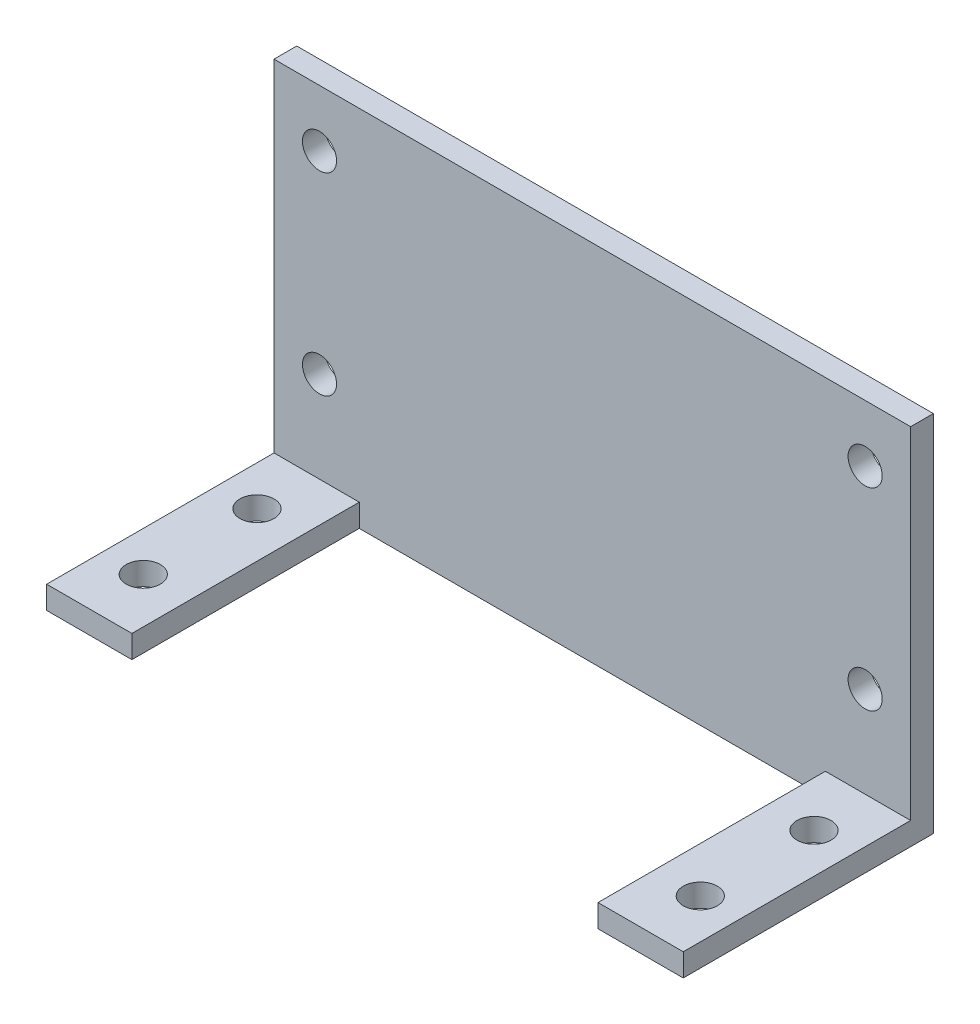
ISO-10303-21;
HEADER;
FILE_DESCRIPTION(('STEP AP214'),'2;1');
FILE_NAME('part.step','',(''),(''),'','','');
FILE_SCHEMA(('AUTOMOTIVE_DESIGN { 1 0 10303 214 1 1 1 1 }'));
ENDSEC;
DATA;
#1=APPLICATION_CONTEXT('core data for automotive mechanical design processes');
#2=APPLICATION_PROTOCOL_DEFINITION('international standard','automotive_design',2000,#1);
#3=PRODUCT_CONTEXT('',#1,'mechanical');
#4=PRODUCT('Part','Part','',(#3));
#5=PRODUCT_RELATED_PRODUCT_CATEGORY('part','',(#4));
#6=PRODUCT_DEFINITION_FORMATION('','',#4);
#7=PRODUCT_DEFINITION_CONTEXT('part definition',#1,'design');
#8=PRODUCT_DEFINITION('design','',#6,#7);
#9=PRODUCT_DEFINITION_SHAPE('','',#8);
#10=(LENGTH_UNIT() NAMED_UNIT(*) SI_UNIT(.MILLI.,.METRE.));
#11=(NAMED_UNIT(*) PLANE_ANGLE_UNIT() SI_UNIT($,.RADIAN.));
#12=(NAMED_UNIT(*) SI_UNIT($,.STERADIAN.) SOLID_ANGLE_UNIT());
#13=UNCERTAINTY_MEASURE_WITH_UNIT(LENGTH_MEASURE(1.E-05),#10,'distance_accuracy_value','');
#14=(GEOMETRIC_REPRESENTATION_CONTEXT(3) GLOBAL_UNCERTAINTY_ASSIGNED_CONTEXT((#13)) GLOBAL_UNIT_ASSIGNED_CONTEXT((#10,
#11,#12)) REPRESENTATION_CONTEXT('',''));
#15=CARTESIAN_POINT('',(0.,0.,0.));
#16=DIRECTION('',(0.,0.,1.));
#17=DIRECTION('',(1.,0.,0.));
#18=AXIS2_PLACEMENT_3D('',#15,#16,#17);
#19=CARTESIAN_POINT('',(-28.,2.,11.));
#20=DIRECTION('',(0.,0.,-1.));
#21=DIRECTION('',(-1.,0.,0.));
#22=AXIS2_PLACEMENT_3D('',#19,#20,#21);
#23=PLANE('',#22);
#24=DIRECTION('',(1.,0.,0.));
#25=VECTOR('',#24,1.);
#26=CARTESIAN_POINT('',(-28.,0.,11.));
#27=LINE('',#26,#25);
#28=CARTESIAN_POINT('',(-28.,0.,11.));
#29=VERTEX_POINT('',#28);
#30=CARTESIAN_POINT('',(-20.5,0.,11.));
#31=VERTEX_POINT('',#30);
#32=EDGE_CURVE('E128',#29,#31,#27,.T.);
#33=ORIENTED_EDGE('',*,*,#32,.T.);
#34=DIRECTION('',(0.,1.,0.));
#35=VECTOR('',#34,1.);
#36=CARTESIAN_POINT('',(-20.5,-18.,11.));
#37=LINE('',#36,#35);
#38=CARTESIAN_POINT('',(-20.5,2.,11.));
#39=VERTEX_POINT('',#38);
#40=EDGE_CURVE('E115',#31,#39,#37,.T.);
#41=ORIENTED_EDGE('',*,*,#40,.T.);
#42=DIRECTION('',(1.,0.,0.));
#43=VECTOR('',#42,1.);
#44=CARTESIAN_POINT('',(-28.,2.,11.));
#45=LINE('',#44,#43);
#46=CARTESIAN_POINT('',(-28.,2.,11.));
#47=VERTEX_POINT('',#46);
#48=EDGE_CURVE('E126',#47,#39,#45,.T.);
#49=ORIENTED_EDGE('',*,*,#48,.F.);
#50=DIRECTION('',(0.,-1.,0.));
#51=VECTOR('',#50,1.);
#52=CARTESIAN_POINT('',(-28.,2.,11.));
#53=LINE('',#52,#51);
#54=EDGE_CURVE('E42',#47,#29,#53,.T.);
#55=ORIENTED_EDGE('',*,*,#54,.T.);
#56=EDGE_LOOP('',(#33,#41,#49,#55));
#57=FACE_BOUND('',#56,.T.);
#58=ADVANCED_FACE('F33',(#57),#23,.F.);
#59=CARTESIAN_POINT('',(0.,2.,0.));
#60=DIRECTION('',(0.,1.,0.));
#61=DIRECTION('',(0.,0.,1.));
#62=AXIS2_PLACEMENT_3D('',#59,#60,#61);
#63=PLANE('',#62);
#64=CARTESIAN_POINT('',(-24.5,2.,6.));
#65=DIRECTION('',(0.,1.,0.));
#66=DIRECTION('',(0.,0.,1.));
#67=AXIS2_PLACEMENT_3D('',#64,#65,#66);
#68=CIRCLE('',#67,1.5);
#69=CARTESIAN_POINT('',(-24.5,2.,7.5));
#70=VERTEX_POINT('',#69);
#71=EDGE_CURVE('E172',#70,#70,#68,.T.);
#72=ORIENTED_EDGE('',*,*,#71,.F.);
#73=EDGE_LOOP('',(#72));
#74=FACE_BOUND('',#73,.T.);
#75=CARTESIAN_POINT('',(-24.5,2.,-4.));
#76=DIRECTION('',(0.,1.,0.));
#77=DIRECTION('',(0.,0.,1.));
#78=AXIS2_PLACEMENT_3D('',#75,#76,#77);
#79=CIRCLE('',#78,1.5);
#80=CARTESIAN_POINT('',(-24.5,2.,-2.49999999999999));
#81=VERTEX_POINT('',#80);
#82=EDGE_CURVE('E168',#81,#81,#79,.T.);
#83=ORIENTED_EDGE('',*,*,#82,.F.);
#84=EDGE_LOOP('',(#83));
#85=FACE_BOUND('',#84,.T.);
#86=DIRECTION('',(0.,0.,1.));
#87=VECTOR('',#86,1.);
#88=CARTESIAN_POINT('',(-20.5,2.,-9.));
#89=LINE('',#88,#87);
#90=CARTESIAN_POINT('',(-20.5,2.,-9.));
#91=VERTEX_POINT('',#90);
#92=EDGE_CURVE('E112',#91,#39,#89,.T.);
#93=ORIENTED_EDGE('',*,*,#92,.F.);
#94=DIRECTION('',(1.,0.,0.));
#95=VECTOR('',#94,1.);
#96=CARTESIAN_POINT('',(-28.,2.,-9.));
#97=LINE('',#96,#95);
#98=CARTESIAN_POINT('',(-28.,2.,-9.));
#99=VERTEX_POINT('',#98);
#100=EDGE_CURVE('E58',#99,#91,#97,.T.);
#101=ORIENTED_EDGE('',*,*,#100,.F.);
#102=DIRECTION('',(0.,0.,1.));
#103=VECTOR('',#102,1.);
#104=CARTESIAN_POINT('',(-28.,2.,-11.));
#105=LINE('',#104,#103);
#106=EDGE_CURVE('E132',#99,#47,#105,.T.);
#107=ORIENTED_EDGE('',*,*,#106,.T.);
#108=ORIENTED_EDGE('',*,*,#48,.T.);
#109=EDGE_LOOP('',(#93,#101,#107,#108));
#110=FACE_BOUND('',#109,.T.);
#111=ADVANCED_FACE('F131',(#74,#85,#110),#63,.T.);
#112=CARTESIAN_POINT('',(-28.,2.,-11.));
#113=DIRECTION('',(1.,0.,0.));
#114=DIRECTION('',(0.,0.,-1.));
#115=AXIS2_PLACEMENT_3D('',#112,#113,#114);
#116=PLANE('',#115);
#117=DIRECTION('',(0.,0.,1.));
#118=VECTOR('',#117,1.);
#119=CARTESIAN_POINT('',(-28.,0.,-11.));
#120=LINE('',#119,#118);
#121=CARTESIAN_POINT('',(-28.,0.,-11.));
#122=VERTEX_POINT('',#121);
#123=EDGE_CURVE('E145',#122,#29,#120,.T.);
#124=ORIENTED_EDGE('',*,*,#123,.T.);
#125=ORIENTED_EDGE('',*,*,#54,.F.);
#126=ORIENTED_EDGE('',*,*,#106,.F.);
#127=DIRECTION('',(0.,-1.,0.));
#128=VECTOR('',#127,1.);
#129=CARTESIAN_POINT('',(-28.,32.,-9.));
#130=LINE('',#129,#128);
#131=CARTESIAN_POINT('',(-28.,32.,-9.));
#132=VERTEX_POINT('',#131);
#133=EDGE_CURVE('E233',#132,#99,#130,.T.);
#134=ORIENTED_EDGE('',*,*,#133,.F.);
#135=DIRECTION('',(0.,0.,1.));
#136=VECTOR('',#135,1.);
#137=CARTESIAN_POINT('',(-28.,32.,-11.));
#138=LINE('',#137,#136);
#139=CARTESIAN_POINT('',(-28.,32.,-11.));
#140=VERTEX_POINT('',#139);
#141=EDGE_CURVE('E151',#140,#132,#138,.T.);
#142=ORIENTED_EDGE('',*,*,#141,.F.);
#143=DIRECTION('',(0.,-1.,0.));
#144=VECTOR('',#143,1.);
#145=CARTESIAN_POINT('',(-28.,2.,-11.));
#146=LINE('',#145,#144);
#147=EDGE_CURVE('E137',#140,#122,#146,.T.);
#148=ORIENTED_EDGE('',*,*,#147,.T.);
#149=EDGE_LOOP('',(#124,#125,#126,#134,#142,#148));
#150=FACE_BOUND('',#149,.T.);
#151=ADVANCED_FACE('F35',(#150),#116,.F.);
#152=CARTESIAN_POINT('',(20.5,2.,11.));
#153=VERTEX_POINT('',#152);
#154=CARTESIAN_POINT('',(28.,2.,11.));
#155=VERTEX_POINT('',#154);
#156=EDGE_CURVE('E134',#153,#155,#45,.T.);
#157=ORIENTED_EDGE('',*,*,#156,.F.);
#158=DIRECTION('',(0.,1.,0.));
#159=VECTOR('',#158,1.);
#160=CARTESIAN_POINT('',(20.5,-18.,11.));
#161=LINE('',#160,#159);
#162=CARTESIAN_POINT('',(20.5,0.,11.));
#163=VERTEX_POINT('',#162);
#164=EDGE_CURVE('E129',#163,#153,#161,.T.);
#165=ORIENTED_EDGE('',*,*,#164,.F.);
#166=CARTESIAN_POINT('',(28.,0.,11.));
#167=VERTEX_POINT('',#166);
#168=EDGE_CURVE('E241',#163,#167,#27,.T.);
#169=ORIENTED_EDGE('',*,*,#168,.T.);
#170=DIRECTION('',(0.,-1.,0.));
#171=VECTOR('',#170,1.);
#172=CARTESIAN_POINT('',(28.,2.,11.));
#173=LINE('',#172,#171);
#174=EDGE_CURVE('E260',#155,#167,#173,.T.);
#175=ORIENTED_EDGE('',*,*,#174,.F.);
#176=EDGE_LOOP('',(#157,#165,#169,#175));
#177=FACE_BOUND('',#176,.T.);
#178=ADVANCED_FACE('F273',(#177),#23,.F.);
#179=CARTESIAN_POINT('',(28.,2.,-11.));
#180=DIRECTION('',(-1.,0.,0.));
#181=DIRECTION('',(0.,0.,1.));
#182=AXIS2_PLACEMENT_3D('',#179,#180,#181);
#183=PLANE('',#182);
#184=DIRECTION('',(0.,0.,-1.));
#185=VECTOR('',#184,1.);
#186=CARTESIAN_POINT('',(28.,0.,-11.));
#187=LINE('',#186,#185);
#188=CARTESIAN_POINT('',(28.,0.,-11.));
#189=VERTEX_POINT('',#188);
#190=EDGE_CURVE('E251',#167,#189,#187,.T.);
#191=ORIENTED_EDGE('',*,*,#190,.T.);
#192=DIRECTION('',(0.,-1.,0.));
#193=VECTOR('',#192,1.);
#194=CARTESIAN_POINT('',(28.,2.,-11.));
#195=LINE('',#194,#193);
#196=CARTESIAN_POINT('',(28.,32.,-11.));
#197=VERTEX_POINT('',#196);
#198=EDGE_CURVE('E257',#197,#189,#195,.T.);
#199=ORIENTED_EDGE('',*,*,#198,.F.);
#200=DIRECTION('',(0.,0.,-1.));
#201=VECTOR('',#200,1.);
#202=CARTESIAN_POINT('',(28.,32.,-11.));
#203=LINE('',#202,#201);
#204=CARTESIAN_POINT('',(28.,32.,-9.));
#205=VERTEX_POINT('',#204);
#206=EDGE_CURVE('E225',#205,#197,#203,.T.);
#207=ORIENTED_EDGE('',*,*,#206,.F.);
#208=DIRECTION('',(0.,-1.,0.));
#209=VECTOR('',#208,1.);
#210=CARTESIAN_POINT('',(28.,32.,-9.));
#211=LINE('',#210,#209);
#212=CARTESIAN_POINT('',(28.,2.,-9.));
#213=VERTEX_POINT('',#212);
#214=EDGE_CURVE('E153',#205,#213,#211,.T.);
#215=ORIENTED_EDGE('',*,*,#214,.T.);
#216=DIRECTION('',(0.,0.,-1.));
#217=VECTOR('',#216,1.);
#218=CARTESIAN_POINT('',(28.,2.,-11.));
#219=LINE('',#218,#217);
#220=EDGE_CURVE('E133',#155,#213,#219,.T.);
#221=ORIENTED_EDGE('',*,*,#220,.F.);
#222=ORIENTED_EDGE('',*,*,#174,.T.);
#223=EDGE_LOOP('',(#191,#199,#207,#215,#221,#222));
#224=FACE_BOUND('',#223,.T.);
#225=ADVANCED_FACE('F264',(#224),#183,.F.);
#226=CARTESIAN_POINT('',(-28.,2.,-11.));
#227=DIRECTION('',(0.,0.,1.));
#228=DIRECTION('',(1.,0.,0.));
#229=AXIS2_PLACEMENT_3D('',#226,#227,#228);
#230=PLANE('',#229);
#231=CARTESIAN_POINT('',(-24.,27.,-11.));
#232=DIRECTION('',(0.,0.,-1.));
#233=DIRECTION('',(-1.,0.,0.));
#234=AXIS2_PLACEMENT_3D('',#231,#232,#233);
#235=CIRCLE('',#234,1.5);
#236=CARTESIAN_POINT('',(-25.5,27.,-11.));
#237=VERTEX_POINT('',#236);
#238=EDGE_CURVE('E200',#237,#237,#235,.T.);
#239=ORIENTED_EDGE('',*,*,#238,.F.);
#240=EDGE_LOOP('',(#239));
#241=FACE_BOUND('',#240,.T.);
#242=CARTESIAN_POINT('',(-24.,10.,-11.));
#243=DIRECTION('',(0.,0.,-1.));
#244=DIRECTION('',(-1.,0.,0.));
#245=AXIS2_PLACEMENT_3D('',#242,#243,#244);
#246=CIRCLE('',#245,1.5);
#247=CARTESIAN_POINT('',(-25.5,10.,-11.));
#248=VERTEX_POINT('',#247);
#249=EDGE_CURVE('E190',#248,#248,#246,.T.);
#250=ORIENTED_EDGE('',*,*,#249,.F.);
#251=EDGE_LOOP('',(#250));
#252=FACE_BOUND('',#251,.T.);
#253=CARTESIAN_POINT('',(24.,10.,-11.));
#254=DIRECTION('',(0.,0.,-1.));
#255=DIRECTION('',(-1.,0.,0.));
#256=AXIS2_PLACEMENT_3D('',#253,#254,#255);
#257=CIRCLE('',#256,1.5);
#258=CARTESIAN_POINT('',(22.5,10.,-11.));
#259=VERTEX_POINT('',#258);
#260=EDGE_CURVE('E187',#259,#259,#257,.T.);
#261=ORIENTED_EDGE('',*,*,#260,.F.);
#262=EDGE_LOOP('',(#261));
#263=FACE_BOUND('',#262,.T.);
#264=CARTESIAN_POINT('',(24.,27.,-11.));
#265=DIRECTION('',(0.,0.,-1.));
#266=DIRECTION('',(-1.,0.,0.));
#267=AXIS2_PLACEMENT_3D('',#264,#265,#266);
#268=CIRCLE('',#267,1.5);
#269=CARTESIAN_POINT('',(22.5,27.,-11.));
#270=VERTEX_POINT('',#269);
#271=EDGE_CURVE('E184',#270,#270,#268,.T.);
#272=ORIENTED_EDGE('',*,*,#271,.F.);
#273=EDGE_LOOP('',(#272));
#274=FACE_BOUND('',#273,.T.);
#275=DIRECTION('',(-1.,0.,0.));
#276=VECTOR('',#275,1.);
#277=CARTESIAN_POINT('',(-28.,0.,-11.));
#278=LINE('',#277,#276);
#279=EDGE_CURVE('E254',#189,#122,#278,.T.);
#280=ORIENTED_EDGE('',*,*,#279,.T.);
#281=ORIENTED_EDGE('',*,*,#147,.F.);
#282=DIRECTION('',(-1.,0.,0.));
#283=VECTOR('',#282,1.);
#284=CARTESIAN_POINT('',(-28.,32.,-11.));
#285=LINE('',#284,#283);
#286=EDGE_CURVE('E157',#197,#140,#285,.T.);
#287=ORIENTED_EDGE('',*,*,#286,.F.);
#288=ORIENTED_EDGE('',*,*,#198,.T.);
#289=EDGE_LOOP('',(#280,#281,#287,#288));
#290=FACE_BOUND('',#289,.T.);
#291=ADVANCED_FACE('F268',(#241,#252,#263,#274,#290),#230,.F.);
#292=CARTESIAN_POINT('',(24.5,2.,6.));
#293=DIRECTION('',(0.,1.,0.));
#294=DIRECTION('',(0.,0.,1.));
#295=AXIS2_PLACEMENT_3D('',#292,#293,#294);
#296=CIRCLE('',#295,1.5);
#297=CARTESIAN_POINT('',(24.5,2.,7.5));
#298=VERTEX_POINT('',#297);
#299=EDGE_CURVE('E180',#298,#298,#296,.T.);
#300=ORIENTED_EDGE('',*,*,#299,.F.);
#301=EDGE_LOOP('',(#300));
#302=FACE_BOUND('',#301,.T.);
#303=CARTESIAN_POINT('',(24.5,2.,-4.));
#304=DIRECTION('',(0.,1.,0.));
#305=DIRECTION('',(0.,0.,1.));
#306=AXIS2_PLACEMENT_3D('',#303,#304,#305);
#307=CIRCLE('',#306,1.5);
#308=CARTESIAN_POINT('',(24.5,2.,-2.5));
#309=VERTEX_POINT('',#308);
#310=EDGE_CURVE('E176',#309,#309,#307,.T.);
#311=ORIENTED_EDGE('',*,*,#310,.F.);
#312=EDGE_LOOP('',(#311));
#313=FACE_BOUND('',#312,.T.);
#314=DIRECTION('',(0.,0.,-1.));
#315=VECTOR('',#314,1.);
#316=CARTESIAN_POINT('',(20.5,2.,-9.));
#317=LINE('',#316,#315);
#318=CARTESIAN_POINT('',(20.5,2.,-9.));
#319=VERTEX_POINT('',#318);
#320=EDGE_CURVE('E50',#153,#319,#317,.T.);
#321=ORIENTED_EDGE('',*,*,#320,.F.);
#322=ORIENTED_EDGE('',*,*,#156,.T.);
#323=ORIENTED_EDGE('',*,*,#220,.T.);
#324=EDGE_CURVE('E152',#319,#213,#97,.T.);
#325=ORIENTED_EDGE('',*,*,#324,.F.);
#326=EDGE_LOOP('',(#321,#322,#323,#325));
#327=FACE_BOUND('',#326,.T.);
#328=ADVANCED_FACE('F275',(#302,#313,#327),#63,.T.);
#329=CARTESIAN_POINT('',(0.,0.,0.));
#330=DIRECTION('',(0.,1.,0.));
#331=DIRECTION('',(0.,0.,1.));
#332=AXIS2_PLACEMENT_3D('',#329,#330,#331);
#333=PLANE('',#332);
#334=CARTESIAN_POINT('',(24.5,0.,6.));
#335=DIRECTION('',(0.,1.,0.));
#336=DIRECTION('',(0.,0.,1.));
#337=AXIS2_PLACEMENT_3D('',#334,#335,#336);
#338=CIRCLE('',#337,1.5);
#339=CARTESIAN_POINT('',(24.5,0.,7.5));
#340=VERTEX_POINT('',#339);
#341=EDGE_CURVE('E177',#340,#340,#338,.T.);
#342=ORIENTED_EDGE('',*,*,#341,.T.);
#343=EDGE_LOOP('',(#342));
#344=FACE_BOUND('',#343,.T.);
#345=CARTESIAN_POINT('',(24.5,0.,-4.));
#346=DIRECTION('',(0.,1.,0.));
#347=DIRECTION('',(0.,0.,1.));
#348=AXIS2_PLACEMENT_3D('',#345,#346,#347);
#349=CIRCLE('',#348,1.5);
#350=CARTESIAN_POINT('',(24.5,0.,-2.5));
#351=VERTEX_POINT('',#350);
#352=EDGE_CURVE('E173',#351,#351,#349,.T.);
#353=ORIENTED_EDGE('',*,*,#352,.T.);
#354=EDGE_LOOP('',(#353));
#355=FACE_BOUND('',#354,.T.);
#356=CARTESIAN_POINT('',(-24.5,0.,6.));
#357=DIRECTION('',(0.,1.,0.));
#358=DIRECTION('',(0.,0.,1.));
#359=AXIS2_PLACEMENT_3D('',#356,#357,#358);
#360=CIRCLE('',#359,1.5);
#361=CARTESIAN_POINT('',(-24.5,0.,7.5));
#362=VERTEX_POINT('',#361);
#363=EDGE_CURVE('E169',#362,#362,#360,.T.);
#364=ORIENTED_EDGE('',*,*,#363,.T.);
#365=EDGE_LOOP('',(#364));
#366=FACE_BOUND('',#365,.T.);
#367=CARTESIAN_POINT('',(-24.5,0.,-4.));
#368=DIRECTION('',(0.,1.,0.));
#369=DIRECTION('',(0.,0.,1.));
#370=AXIS2_PLACEMENT_3D('',#367,#368,#369);
#371=CIRCLE('',#370,1.5);
#372=CARTESIAN_POINT('',(-24.5,0.,-2.49999999999999));
#373=VERTEX_POINT('',#372);
#374=EDGE_CURVE('E120',#373,#373,#371,.T.);
#375=ORIENTED_EDGE('',*,*,#374,.T.);
#376=EDGE_LOOP('',(#375));
#377=FACE_BOUND('',#376,.T.);
#378=DIRECTION('',(-1.,0.,0.));
#379=VECTOR('',#378,1.);
#380=CARTESIAN_POINT('',(0.,0.,-9.));
#381=LINE('',#380,#379);
#382=CARTESIAN_POINT('',(20.5,0.,-9.));
#383=VERTEX_POINT('',#382);
#384=CARTESIAN_POINT('',(-20.5,0.,-9.));
#385=VERTEX_POINT('',#384);
#386=EDGE_CURVE('E11',#383,#385,#381,.T.);
#387=ORIENTED_EDGE('',*,*,#386,.T.);
#388=DIRECTION('',(0.,0.,1.));
#389=VECTOR('',#388,1.);
#390=CARTESIAN_POINT('',(-20.5,0.,0.));
#391=LINE('',#390,#389);
#392=EDGE_CURVE('E162',#385,#31,#391,.T.);
#393=ORIENTED_EDGE('',*,*,#392,.T.);
#394=ORIENTED_EDGE('',*,*,#32,.F.);
#395=ORIENTED_EDGE('',*,*,#123,.F.);
#396=ORIENTED_EDGE('',*,*,#279,.F.);
#397=ORIENTED_EDGE('',*,*,#190,.F.);
#398=ORIENTED_EDGE('',*,*,#168,.F.);
#399=DIRECTION('',(0.,0.,-1.));
#400=VECTOR('',#399,1.);
#401=CARTESIAN_POINT('',(20.5,0.,0.));
#402=LINE('',#401,#400);
#403=EDGE_CURVE('E215',#163,#383,#402,.T.);
#404=ORIENTED_EDGE('',*,*,#403,.T.);
#405=EDGE_LOOP('',(#387,#393,#394,#395,#396,#397,#398,#404));
#406=FACE_BOUND('',#405,.T.);
#407=ADVANCED_FACE('F270',(#344,#355,#366,#377,#406),#333,.F.);
#408=CARTESIAN_POINT('',(-28.,32.,-9.));
#409=DIRECTION('',(0.,0.,-1.));
#410=DIRECTION('',(-1.,0.,0.));
#411=AXIS2_PLACEMENT_3D('',#408,#409,#410);
#412=PLANE('',#411);
#413=CARTESIAN_POINT('',(-24.,27.,-9.));
#414=DIRECTION('',(0.,0.,-1.));
#415=DIRECTION('',(-1.,0.,0.));
#416=AXIS2_PLACEMENT_3D('',#413,#414,#415);
#417=CIRCLE('',#416,1.5);
#418=CARTESIAN_POINT('',(-25.5,27.,-9.));
#419=VERTEX_POINT('',#418);
#420=EDGE_CURVE('E37',#419,#419,#417,.T.);
#421=ORIENTED_EDGE('',*,*,#420,.T.);
#422=EDGE_LOOP('',(#421));
#423=FACE_BOUND('',#422,.T.);
#424=CARTESIAN_POINT('',(-24.,10.,-9.));
#425=DIRECTION('',(0.,0.,-1.));
#426=DIRECTION('',(-1.,0.,0.));
#427=AXIS2_PLACEMENT_3D('',#424,#425,#426);
#428=CIRCLE('',#427,1.5);
#429=CARTESIAN_POINT('',(-25.5,10.,-9.));
#430=VERTEX_POINT('',#429);
#431=EDGE_CURVE('E188',#430,#430,#428,.T.);
#432=ORIENTED_EDGE('',*,*,#431,.T.);
#433=EDGE_LOOP('',(#432));
#434=FACE_BOUND('',#433,.T.);
#435=CARTESIAN_POINT('',(24.,10.,-9.));
#436=DIRECTION('',(0.,0.,-1.));
#437=DIRECTION('',(-1.,0.,0.));
#438=AXIS2_PLACEMENT_3D('',#435,#436,#437);
#439=CIRCLE('',#438,1.5);
#440=CARTESIAN_POINT('',(22.5,10.,-9.));
#441=VERTEX_POINT('',#440);
#442=EDGE_CURVE('E185',#441,#441,#439,.T.);
#443=ORIENTED_EDGE('',*,*,#442,.T.);
#444=EDGE_LOOP('',(#443));
#445=FACE_BOUND('',#444,.T.);
#446=CARTESIAN_POINT('',(24.,27.,-9.));
#447=DIRECTION('',(0.,0.,-1.));
#448=DIRECTION('',(-1.,0.,0.));
#449=AXIS2_PLACEMENT_3D('',#446,#447,#448);
#450=CIRCLE('',#449,1.5);
#451=CARTESIAN_POINT('',(22.5,27.,-9.));
#452=VERTEX_POINT('',#451);
#453=EDGE_CURVE('E181',#452,#452,#450,.T.);
#454=ORIENTED_EDGE('',*,*,#453,.T.);
#455=EDGE_LOOP('',(#454));
#456=FACE_BOUND('',#455,.T.);
#457=ORIENTED_EDGE('',*,*,#100,.T.);
#458=DIRECTION('',(0.,1.,0.));
#459=VECTOR('',#458,1.);
#460=CARTESIAN_POINT('',(-20.5,-18.,-9.));
#461=LINE('',#460,#459);
#462=EDGE_CURVE('E118',#385,#91,#461,.T.);
#463=ORIENTED_EDGE('',*,*,#462,.F.);
#464=ORIENTED_EDGE('',*,*,#386,.F.);
#465=DIRECTION('',(0.,1.,0.));
#466=VECTOR('',#465,1.);
#467=CARTESIAN_POINT('',(20.5,-18.,-9.));
#468=LINE('',#467,#466);
#469=EDGE_CURVE('E216',#383,#319,#468,.T.);
#470=ORIENTED_EDGE('',*,*,#469,.T.);
#471=ORIENTED_EDGE('',*,*,#324,.T.);
#472=ORIENTED_EDGE('',*,*,#214,.F.);
#473=DIRECTION('',(1.,0.,0.));
#474=VECTOR('',#473,1.);
#475=CARTESIAN_POINT('',(-28.,32.,-9.));
#476=LINE('',#475,#474);
#477=EDGE_CURVE('E224',#132,#205,#476,.T.);
#478=ORIENTED_EDGE('',*,*,#477,.F.);
#479=ORIENTED_EDGE('',*,*,#133,.T.);
#480=EDGE_LOOP('',(#457,#463,#464,#470,#471,#472,#478,#479));
#481=FACE_BOUND('',#480,.T.);
#482=ADVANCED_FACE('F262',(#423,#434,#445,#456,#481),#412,.F.);
#483=CARTESIAN_POINT('',(0.,32.,0.));
#484=DIRECTION('',(0.,1.,0.));
#485=DIRECTION('',(0.,0.,1.));
#486=AXIS2_PLACEMENT_3D('',#483,#484,#485);
#487=PLANE('',#486);
#488=ORIENTED_EDGE('',*,*,#141,.T.);
#489=ORIENTED_EDGE('',*,*,#477,.T.);
#490=ORIENTED_EDGE('',*,*,#206,.T.);
#491=ORIENTED_EDGE('',*,*,#286,.T.);
#492=EDGE_LOOP('',(#488,#489,#490,#491));
#493=FACE_BOUND('',#492,.T.);
#494=ADVANCED_FACE('F261',(#493),#487,.T.);
#495=CARTESIAN_POINT('',(-20.5,-18.,-9.));
#496=DIRECTION('',(-1.,0.,0.));
#497=DIRECTION('',(0.,0.,1.));
#498=AXIS2_PLACEMENT_3D('',#495,#496,#497);
#499=PLANE('',#498);
#500=ORIENTED_EDGE('',*,*,#462,.T.);
#501=ORIENTED_EDGE('',*,*,#92,.T.);
#502=ORIENTED_EDGE('',*,*,#40,.F.);
#503=ORIENTED_EDGE('',*,*,#392,.F.);
#504=EDGE_LOOP('',(#500,#501,#502,#503));
#505=FACE_BOUND('',#504,.T.);
#506=ADVANCED_FACE('F114',(#505),#499,.F.);
#507=CARTESIAN_POINT('',(20.5,-18.,-9.));
#508=DIRECTION('',(1.,0.,0.));
#509=DIRECTION('',(0.,0.,-1.));
#510=AXIS2_PLACEMENT_3D('',#507,#508,#509);
#511=PLANE('',#510);
#512=ORIENTED_EDGE('',*,*,#164,.T.);
#513=ORIENTED_EDGE('',*,*,#320,.T.);
#514=ORIENTED_EDGE('',*,*,#469,.F.);
#515=ORIENTED_EDGE('',*,*,#403,.F.);
#516=EDGE_LOOP('',(#512,#513,#514,#515));
#517=FACE_BOUND('',#516,.T.);
#518=ADVANCED_FACE('F271',(#517),#511,.F.);
#519=CARTESIAN_POINT('',(-24.5,-18.,-4.));
#520=DIRECTION('',(0.,1.,0.));
#521=DIRECTION('',(0.,0.,1.));
#522=AXIS2_PLACEMENT_3D('',#519,#520,#521);
#523=CYLINDRICAL_SURFACE('',#522,1.5);
#524=ORIENTED_EDGE('',*,*,#82,.T.);
#525=EDGE_LOOP('',(#524));
#526=FACE_BOUND('',#525,.T.);
#527=ORIENTED_EDGE('',*,*,#374,.F.);
#528=EDGE_LOOP('',(#527));
#529=FACE_BOUND('',#528,.T.);
#530=ADVANCED_FACE('F332',(#526,#529),#523,.F.);
#531=CARTESIAN_POINT('',(-24.5,-18.,6.));
#532=DIRECTION('',(0.,1.,0.));
#533=DIRECTION('',(0.,0.,1.));
#534=AXIS2_PLACEMENT_3D('',#531,#532,#533);
#535=CYLINDRICAL_SURFACE('',#534,1.5);
#536=ORIENTED_EDGE('',*,*,#71,.T.);
#537=EDGE_LOOP('',(#536));
#538=FACE_BOUND('',#537,.T.);
#539=ORIENTED_EDGE('',*,*,#363,.F.);
#540=EDGE_LOOP('',(#539));
#541=FACE_BOUND('',#540,.T.);
#542=ADVANCED_FACE('F337',(#538,#541),#535,.F.);
#543=CARTESIAN_POINT('',(24.5,-18.,-4.));
#544=DIRECTION('',(0.,1.,0.));
#545=DIRECTION('',(0.,0.,1.));
#546=AXIS2_PLACEMENT_3D('',#543,#544,#545);
#547=CYLINDRICAL_SURFACE('',#546,1.5);
#548=ORIENTED_EDGE('',*,*,#310,.T.);
#549=EDGE_LOOP('',(#548));
#550=FACE_BOUND('',#549,.T.);
#551=ORIENTED_EDGE('',*,*,#352,.F.);
#552=EDGE_LOOP('',(#551));
#553=FACE_BOUND('',#552,.T.);
#554=ADVANCED_FACE('F347',(#550,#553),#547,.F.);
#555=CARTESIAN_POINT('',(24.5,-18.,6.));
#556=DIRECTION('',(0.,1.,0.));
#557=DIRECTION('',(0.,0.,1.));
#558=AXIS2_PLACEMENT_3D('',#555,#556,#557);
#559=CYLINDRICAL_SURFACE('',#558,1.5);
#560=ORIENTED_EDGE('',*,*,#299,.T.);
#561=EDGE_LOOP('',(#560));
#562=FACE_BOUND('',#561,.T.);
#563=ORIENTED_EDGE('',*,*,#341,.F.);
#564=EDGE_LOOP('',(#563));
#565=FACE_BOUND('',#564,.T.);
#566=ADVANCED_FACE('F357',(#562,#565),#559,.F.);
#567=CARTESIAN_POINT('',(24.,27.,9.));
#568=DIRECTION('',(0.,0.,-1.));
#569=DIRECTION('',(-1.,0.,0.));
#570=AXIS2_PLACEMENT_3D('',#567,#568,#569);
#571=CYLINDRICAL_SURFACE('',#570,1.5);
#572=ORIENTED_EDGE('',*,*,#271,.T.);
#573=EDGE_LOOP('',(#572));
#574=FACE_BOUND('',#573,.T.);
#575=ORIENTED_EDGE('',*,*,#453,.F.);
#576=EDGE_LOOP('',(#575));
#577=FACE_BOUND('',#576,.T.);
#578=ADVANCED_FACE('F367',(#574,#577),#571,.F.);
#579=CARTESIAN_POINT('',(24.,10.,9.));
#580=DIRECTION('',(0.,0.,-1.));
#581=DIRECTION('',(-1.,0.,0.));
#582=AXIS2_PLACEMENT_3D('',#579,#580,#581);
#583=CYLINDRICAL_SURFACE('',#582,1.5);
#584=ORIENTED_EDGE('',*,*,#260,.T.);
#585=EDGE_LOOP('',(#584));
#586=FACE_BOUND('',#585,.T.);
#587=ORIENTED_EDGE('',*,*,#442,.F.);
#588=EDGE_LOOP('',(#587));
#589=FACE_BOUND('',#588,.T.);
#590=ADVANCED_FACE('F394',(#586,#589),#583,.F.);
#591=CARTESIAN_POINT('',(-24.,10.,9.));
#592=DIRECTION('',(0.,0.,-1.));
#593=DIRECTION('',(-1.,0.,0.));
#594=AXIS2_PLACEMENT_3D('',#591,#592,#593);
#595=CYLINDRICAL_SURFACE('',#594,1.5);
#596=ORIENTED_EDGE('',*,*,#249,.T.);
#597=EDGE_LOOP('',(#596));
#598=FACE_BOUND('',#597,.T.);
#599=ORIENTED_EDGE('',*,*,#431,.F.);
#600=EDGE_LOOP('',(#599));
#601=FACE_BOUND('',#600,.T.);
#602=ADVANCED_FACE('F404',(#598,#601),#595,.F.);
#603=CARTESIAN_POINT('',(-24.,27.,9.));
#604=DIRECTION('',(0.,0.,-1.));
#605=DIRECTION('',(-1.,0.,0.));
#606=AXIS2_PLACEMENT_3D('',#603,#604,#605);
#607=CYLINDRICAL_SURFACE('',#606,1.5);
#608=ORIENTED_EDGE('',*,*,#238,.T.);
#609=EDGE_LOOP('',(#608));
#610=FACE_BOUND('',#609,.T.);
#611=ORIENTED_EDGE('',*,*,#420,.F.);
#612=EDGE_LOOP('',(#611));
#613=FACE_BOUND('',#612,.T.);
#614=ADVANCED_FACE('F414',(#610,#613),#607,.F.);
#615=CLOSED_SHELL('',(#58,#111,#151,#178,#225,#291,#328,#407,#482,#494,#506,#518,#530,#542,#554,
#566,#578,#590,#602,#614));
#616=MANIFOLD_SOLID_BREP('B2',#615);
#617=ADVANCED_BREP_SHAPE_REPRESENTATION('',(#18,#616),#14);
#618=SHAPE_DEFINITION_REPRESENTATION(#9,#617);
ENDSEC;
END-ISO-10303-21;
